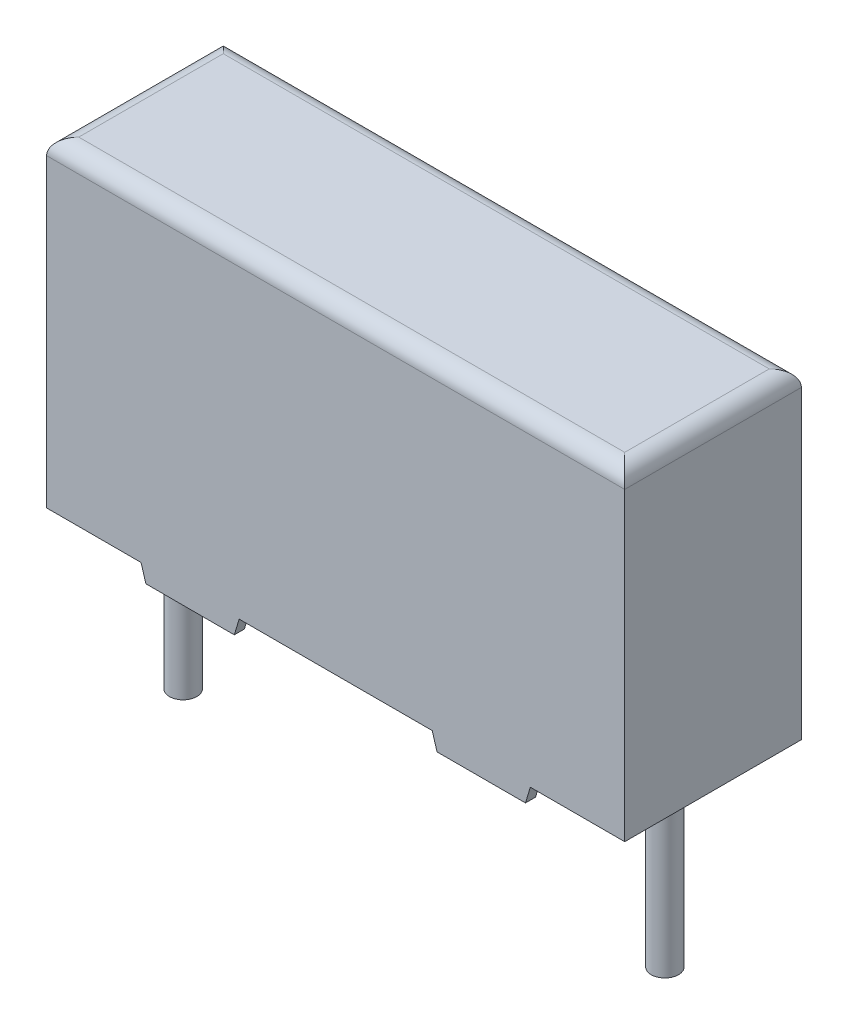
ISO-10303-21;
HEADER;
FILE_DESCRIPTION(('STEP AP214'),'2;1');
FILE_NAME('part.step','',(''),(''),'','','');
FILE_SCHEMA(('AUTOMOTIVE_DESIGN { 1 0 10303 214 1 1 1 1 }'));
ENDSEC;
DATA;
#1=APPLICATION_CONTEXT('core data for automotive mechanical design processes');
#2=APPLICATION_PROTOCOL_DEFINITION('international standard','automotive_design',2000,#1);
#3=PRODUCT_CONTEXT('',#1,'mechanical');
#4=PRODUCT('Part','Part','',(#3));
#5=PRODUCT_RELATED_PRODUCT_CATEGORY('part','',(#4));
#6=PRODUCT_DEFINITION_FORMATION('','',#4);
#7=PRODUCT_DEFINITION_CONTEXT('part definition',#1,'design');
#8=PRODUCT_DEFINITION('design','',#6,#7);
#9=PRODUCT_DEFINITION_SHAPE('','',#8);
#10=(LENGTH_UNIT() NAMED_UNIT(*) SI_UNIT(.MILLI.,.METRE.));
#11=(NAMED_UNIT(*) PLANE_ANGLE_UNIT() SI_UNIT($,.RADIAN.));
#12=(NAMED_UNIT(*) SI_UNIT($,.STERADIAN.) SOLID_ANGLE_UNIT());
#13=UNCERTAINTY_MEASURE_WITH_UNIT(LENGTH_MEASURE(1.E-05),#10,'distance_accuracy_value','');
#14=(GEOMETRIC_REPRESENTATION_CONTEXT(3) GLOBAL_UNCERTAINTY_ASSIGNED_CONTEXT((#13)) GLOBAL_UNIT_ASSIGNED_CONTEXT((#10,
#11,#12)) REPRESENTATION_CONTEXT('',''));
#15=CARTESIAN_POINT('',(0.,0.,0.));
#16=DIRECTION('',(0.,0.,1.));
#17=DIRECTION('',(1.,0.,0.));
#18=AXIS2_PLACEMENT_3D('',#15,#16,#17);
#19=CARTESIAN_POINT('',(16.5,-5.5,2.75));
#20=DIRECTION('',(0.,1.,0.));
#21=DIRECTION('',(0.,0.,1.));
#22=AXIS2_PLACEMENT_3D('',#19,#20,#21);
#23=CYLINDRICAL_SURFACE('',#22,0.425);
#24=CARTESIAN_POINT('',(16.5,-5.5,2.75));
#25=DIRECTION('',(0.,1.,0.));
#26=DIRECTION('',(0.,0.,-1.));
#27=AXIS2_PLACEMENT_3D('',#24,#25,#26);
#28=CIRCLE('',#27,0.425);
#29=CARTESIAN_POINT('',(16.5,-5.5,2.325));
#30=VERTEX_POINT('',#29);
#31=EDGE_CURVE('E11',#30,#30,#28,.T.);
#32=ORIENTED_EDGE('',*,*,#31,.T.);
#33=EDGE_LOOP('',(#32));
#34=FACE_BOUND('',#33,.T.);
#35=CARTESIAN_POINT('',(16.5,0.,2.75));
#36=DIRECTION('',(0.,1.,0.));
#37=DIRECTION('',(0.,0.,-1.));
#38=AXIS2_PLACEMENT_3D('',#35,#36,#37);
#39=CIRCLE('',#38,0.425);
#40=CARTESIAN_POINT('',(16.5,0.,3.175));
#41=VERTEX_POINT('',#40);
#42=EDGE_CURVE('E398',#41,#41,#39,.T.);
#43=ORIENTED_EDGE('',*,*,#42,.F.);
#44=EDGE_LOOP('',(#43));
#45=FACE_BOUND('',#44,.T.);
#46=ADVANCED_FACE('F17',(#34,#45),#23,.T.);
#47=CARTESIAN_POINT('',(1.5,-5.5,2.75));
#48=DIRECTION('',(0.,1.,0.));
#49=DIRECTION('',(0.,0.,1.));
#50=AXIS2_PLACEMENT_3D('',#47,#48,#49);
#51=CYLINDRICAL_SURFACE('',#50,0.425);
#52=CARTESIAN_POINT('',(1.5,-5.5,2.75));
#53=DIRECTION('',(0.,-1.,0.));
#54=DIRECTION('',(0.,0.,-1.));
#55=AXIS2_PLACEMENT_3D('',#52,#53,#54);
#56=CIRCLE('',#55,0.425);
#57=CARTESIAN_POINT('',(1.5,-5.5,3.175));
#58=VERTEX_POINT('',#57);
#59=EDGE_CURVE('E344',#58,#58,#56,.T.);
#60=ORIENTED_EDGE('',*,*,#59,.F.);
#61=EDGE_LOOP('',(#60));
#62=FACE_BOUND('',#61,.T.);
#63=CARTESIAN_POINT('',(1.5,0.,2.75));
#64=DIRECTION('',(0.,-1.,0.));
#65=DIRECTION('',(0.,0.,1.));
#66=AXIS2_PLACEMENT_3D('',#63,#64,#65);
#67=CIRCLE('',#66,0.425);
#68=CARTESIAN_POINT('',(1.5,0.,3.175));
#69=VERTEX_POINT('',#68);
#70=EDGE_CURVE('E28',#69,#69,#67,.T.);
#71=ORIENTED_EDGE('',*,*,#70,.T.);
#72=EDGE_LOOP('',(#71));
#73=FACE_BOUND('',#72,.T.);
#74=ADVANCED_FACE('F598',(#62,#73),#51,.T.);
#75=CARTESIAN_POINT('',(0.,0.,5.5));
#76=DIRECTION('',(0.,1.,0.));
#77=DIRECTION('',(1.,0.,0.));
#78=AXIS2_PLACEMENT_3D('',#75,#76,#77);
#79=PLANE('',#78);
#80=DIRECTION('',(0.,0.,-1.));
#81=VECTOR('',#80,1.);
#82=CARTESIAN_POINT('',(2.94,0.,0.3135));
#83=LINE('',#82,#81);
#84=CARTESIAN_POINT('',(2.94,0.,0.3135));
#85=VERTEX_POINT('',#84);
#86=CARTESIAN_POINT('',(2.94,0.,0.));
#87=VERTEX_POINT('',#86);
#88=EDGE_CURVE('E397',#85,#87,#83,.T.);
#89=ORIENTED_EDGE('',*,*,#88,.F.);
#90=DIRECTION('',(-1.,0.,0.));
#91=VECTOR('',#90,1.);
#92=CARTESIAN_POINT('',(2.94,0.,0.3135));
#93=LINE('',#92,#91);
#94=CARTESIAN_POINT('',(5.994,0.,0.3135));
#95=VERTEX_POINT('',#94);
#96=EDGE_CURVE('E393',#95,#85,#93,.T.);
#97=ORIENTED_EDGE('',*,*,#96,.F.);
#98=DIRECTION('',(0.,0.,-1.));
#99=VECTOR('',#98,1.);
#100=CARTESIAN_POINT('',(5.994,0.,0.3135));
#101=LINE('',#100,#99);
#102=CARTESIAN_POINT('',(5.994,0.,0.));
#103=VERTEX_POINT('',#102);
#104=EDGE_CURVE('E286',#95,#103,#101,.T.);
#105=ORIENTED_EDGE('',*,*,#104,.T.);
#106=DIRECTION('',(1.,0.,0.));
#107=VECTOR('',#106,1.);
#108=CARTESIAN_POINT('',(0.,0.,0.));
#109=LINE('',#108,#107);
#110=CARTESIAN_POINT('',(12.006,0.,0.));
#111=VERTEX_POINT('',#110);
#112=EDGE_CURVE('E284',#103,#111,#109,.T.);
#113=ORIENTED_EDGE('',*,*,#112,.T.);
#114=DIRECTION('',(0.,0.,-1.));
#115=VECTOR('',#114,1.);
#116=CARTESIAN_POINT('',(12.006,0.,0.3135));
#117=LINE('',#116,#115);
#118=CARTESIAN_POINT('',(12.006,0.,0.3135));
#119=VERTEX_POINT('',#118);
#120=EDGE_CURVE('E461',#119,#111,#117,.T.);
#121=ORIENTED_EDGE('',*,*,#120,.F.);
#122=DIRECTION('',(1.,0.,0.));
#123=VECTOR('',#122,1.);
#124=CARTESIAN_POINT('',(15.06,0.,0.3135));
#125=LINE('',#124,#123);
#126=CARTESIAN_POINT('',(15.06,0.,0.3135));
#127=VERTEX_POINT('',#126);
#128=EDGE_CURVE('E287',#119,#127,#125,.T.);
#129=ORIENTED_EDGE('',*,*,#128,.T.);
#130=DIRECTION('',(0.,0.,-1.));
#131=VECTOR('',#130,1.);
#132=CARTESIAN_POINT('',(15.06,0.,0.3135));
#133=LINE('',#132,#131);
#134=CARTESIAN_POINT('',(15.06,0.,0.));
#135=VERTEX_POINT('',#134);
#136=EDGE_CURVE('E183',#127,#135,#133,.T.);
#137=ORIENTED_EDGE('',*,*,#136,.T.);
#138=DIRECTION('',(1.,0.,0.));
#139=VECTOR('',#138,1.);
#140=CARTESIAN_POINT('',(0.,0.,0.));
#141=LINE('',#140,#139);
#142=CARTESIAN_POINT('',(18.,0.,0.));
#143=VERTEX_POINT('',#142);
#144=EDGE_CURVE('E171',#135,#143,#141,.T.);
#145=ORIENTED_EDGE('',*,*,#144,.T.);
#146=DIRECTION('',(0.,0.,-1.));
#147=VECTOR('',#146,1.);
#148=CARTESIAN_POINT('',(18.,0.,5.5));
#149=LINE('',#148,#147);
#150=CARTESIAN_POINT('',(18.,0.,5.5));
#151=VERTEX_POINT('',#150);
#152=EDGE_CURVE('E330',#151,#143,#149,.T.);
#153=ORIENTED_EDGE('',*,*,#152,.F.);
#154=DIRECTION('',(1.,0.,0.));
#155=VECTOR('',#154,1.);
#156=CARTESIAN_POINT('',(0.,0.,5.5));
#157=LINE('',#156,#155);
#158=CARTESIAN_POINT('',(15.06,0.,5.5));
#159=VERTEX_POINT('',#158);
#160=EDGE_CURVE('E419',#159,#151,#157,.T.);
#161=ORIENTED_EDGE('',*,*,#160,.F.);
#162=DIRECTION('',(0.,0.,1.));
#163=VECTOR('',#162,1.);
#164=CARTESIAN_POINT('',(15.06,0.,5.1865));
#165=LINE('',#164,#163);
#166=CARTESIAN_POINT('',(15.06,0.,5.1865));
#167=VERTEX_POINT('',#166);
#168=EDGE_CURVE('E256',#167,#159,#165,.T.);
#169=ORIENTED_EDGE('',*,*,#168,.F.);
#170=DIRECTION('',(1.,0.,0.));
#171=VECTOR('',#170,1.);
#172=CARTESIAN_POINT('',(15.06,0.,5.1865));
#173=LINE('',#172,#171);
#174=CARTESIAN_POINT('',(12.006,0.,5.1865));
#175=VERTEX_POINT('',#174);
#176=EDGE_CURVE('E407',#175,#167,#173,.T.);
#177=ORIENTED_EDGE('',*,*,#176,.F.);
#178=DIRECTION('',(0.,0.,1.));
#179=VECTOR('',#178,1.);
#180=CARTESIAN_POINT('',(12.006,0.,5.1865));
#181=LINE('',#180,#179);
#182=CARTESIAN_POINT('',(12.006,0.,5.5));
#183=VERTEX_POINT('',#182);
#184=EDGE_CURVE('E362',#175,#183,#181,.T.);
#185=ORIENTED_EDGE('',*,*,#184,.T.);
#186=DIRECTION('',(1.,0.,0.));
#187=VECTOR('',#186,1.);
#188=CARTESIAN_POINT('',(0.,0.,5.5));
#189=LINE('',#188,#187);
#190=CARTESIAN_POINT('',(5.994,0.,5.5));
#191=VERTEX_POINT('',#190);
#192=EDGE_CURVE('E431',#191,#183,#189,.T.);
#193=ORIENTED_EDGE('',*,*,#192,.F.);
#194=DIRECTION('',(0.,0.,1.));
#195=VECTOR('',#194,1.);
#196=CARTESIAN_POINT('',(5.994,0.,5.1865));
#197=LINE('',#196,#195);
#198=CARTESIAN_POINT('',(5.994,0.,5.1865));
#199=VERTEX_POINT('',#198);
#200=EDGE_CURVE('E366',#199,#191,#197,.T.);
#201=ORIENTED_EDGE('',*,*,#200,.F.);
#202=DIRECTION('',(-1.,0.,0.));
#203=VECTOR('',#202,1.);
#204=CARTESIAN_POINT('',(2.94,0.,5.1865));
#205=LINE('',#204,#203);
#206=CARTESIAN_POINT('',(2.94,0.,5.1865));
#207=VERTEX_POINT('',#206);
#208=EDGE_CURVE('E357',#199,#207,#205,.T.);
#209=ORIENTED_EDGE('',*,*,#208,.T.);
#210=DIRECTION('',(0.,0.,1.));
#211=VECTOR('',#210,1.);
#212=CARTESIAN_POINT('',(2.94,0.,5.1865));
#213=LINE('',#212,#211);
#214=CARTESIAN_POINT('',(2.94,0.,5.5));
#215=VERTEX_POINT('',#214);
#216=EDGE_CURVE('E353',#207,#215,#213,.T.);
#217=ORIENTED_EDGE('',*,*,#216,.T.);
#218=DIRECTION('',(1.,0.,0.));
#219=VECTOR('',#218,1.);
#220=CARTESIAN_POINT('',(0.,0.,5.5));
#221=LINE('',#220,#219);
#222=CARTESIAN_POINT('',(0.,0.,5.5));
#223=VERTEX_POINT('',#222);
#224=EDGE_CURVE('E314',#223,#215,#221,.T.);
#225=ORIENTED_EDGE('',*,*,#224,.F.);
#226=DIRECTION('',(0.,0.,-1.));
#227=VECTOR('',#226,1.);
#228=CARTESIAN_POINT('',(0.,0.,5.5));
#229=LINE('',#228,#227);
#230=CARTESIAN_POINT('',(0.,0.,0.));
#231=VERTEX_POINT('',#230);
#232=EDGE_CURVE('E358',#223,#231,#229,.T.);
#233=ORIENTED_EDGE('',*,*,#232,.T.);
#234=DIRECTION('',(1.,0.,0.));
#235=VECTOR('',#234,1.);
#236=CARTESIAN_POINT('',(0.,0.,0.));
#237=LINE('',#236,#235);
#238=EDGE_CURVE('E402',#231,#87,#237,.T.);
#239=ORIENTED_EDGE('',*,*,#238,.T.);
#240=EDGE_LOOP('',(#89,#97,#105,#113,#121,#129,#137,#145,#153,#161,#169,#177,#185,#193,#201,
#209,#217,#225,#233,#239));
#241=FACE_BOUND('',#240,.T.);
#242=ORIENTED_EDGE('',*,*,#42,.T.);
#243=EDGE_LOOP('',(#242));
#244=FACE_BOUND('',#243,.T.);
#245=ORIENTED_EDGE('',*,*,#70,.F.);
#246=EDGE_LOOP('',(#245));
#247=FACE_BOUND('',#246,.T.);
#248=ADVANCED_FACE('F529',(#241,#244,#247),#79,.F.);
#249=CARTESIAN_POINT('',(0.,0.,5.5));
#250=DIRECTION('',(1.,0.,0.));
#251=DIRECTION('',(0.,1.,0.));
#252=AXIS2_PLACEMENT_3D('',#249,#250,#251);
#253=PLANE('',#252);
#254=DIRECTION('',(0.,-1.,0.));
#255=VECTOR('',#254,1.);
#256=CARTESIAN_POINT('',(0.,0.,5.5));
#257=LINE('',#256,#255);
#258=CARTESIAN_POINT('',(0.,9.5,5.5));
#259=VERTEX_POINT('',#258);
#260=EDGE_CURVE('E446',#259,#223,#257,.T.);
#261=ORIENTED_EDGE('',*,*,#260,.F.);
#262=DIRECTION('',(0.,0.,-1.));
#263=VECTOR('',#262,1.);
#264=CARTESIAN_POINT('',(0.,9.5,5.5));
#265=LINE('',#264,#263);
#266=CARTESIAN_POINT('',(0.,9.5,0.));
#267=VERTEX_POINT('',#266);
#268=EDGE_CURVE('E388',#259,#267,#265,.T.);
#269=ORIENTED_EDGE('',*,*,#268,.T.);
#270=DIRECTION('',(0.,-1.,0.));
#271=VECTOR('',#270,1.);
#272=CARTESIAN_POINT('',(0.,0.,0.));
#273=LINE('',#272,#271);
#274=EDGE_CURVE('E352',#267,#231,#273,.T.);
#275=ORIENTED_EDGE('',*,*,#274,.T.);
#276=ORIENTED_EDGE('',*,*,#232,.F.);
#277=EDGE_LOOP('',(#261,#269,#275,#276));
#278=FACE_BOUND('',#277,.T.);
#279=ADVANCED_FACE('F569',(#278),#253,.F.);
#280=CARTESIAN_POINT('',(18.,0.,5.5));
#281=DIRECTION('',(-1.,0.,0.));
#282=DIRECTION('',(0.,0.,1.));
#283=AXIS2_PLACEMENT_3D('',#280,#281,#282);
#284=PLANE('',#283);
#285=DIRECTION('',(0.,1.,0.));
#286=VECTOR('',#285,1.);
#287=CARTESIAN_POINT('',(18.,0.,0.));
#288=LINE('',#287,#286);
#289=CARTESIAN_POINT('',(18.,9.5,0.));
#290=VERTEX_POINT('',#289);
#291=EDGE_CURVE('E348',#143,#290,#288,.T.);
#292=ORIENTED_EDGE('',*,*,#291,.T.);
#293=DIRECTION('',(0.,0.,1.));
#294=VECTOR('',#293,1.);
#295=CARTESIAN_POINT('',(18.,9.5,5.5));
#296=LINE('',#295,#294);
#297=CARTESIAN_POINT('',(18.,9.5,5.5));
#298=VERTEX_POINT('',#297);
#299=EDGE_CURVE('E336',#290,#298,#296,.T.);
#300=ORIENTED_EDGE('',*,*,#299,.T.);
#301=DIRECTION('',(0.,1.,0.));
#302=VECTOR('',#301,1.);
#303=CARTESIAN_POINT('',(18.,0.,5.5));
#304=LINE('',#303,#302);
#305=EDGE_CURVE('E361',#151,#298,#304,.T.);
#306=ORIENTED_EDGE('',*,*,#305,.F.);
#307=ORIENTED_EDGE('',*,*,#152,.T.);
#308=EDGE_LOOP('',(#292,#300,#306,#307));
#309=FACE_BOUND('',#308,.T.);
#310=ADVANCED_FACE('F584',(#309),#284,.F.);
#311=CARTESIAN_POINT('',(0.,10.,5.5));
#312=DIRECTION('',(0.,-1.,0.));
#313=DIRECTION('',(0.,0.,-1.));
#314=AXIS2_PLACEMENT_3D('',#311,#312,#313);
#315=PLANE('',#314);
#316=DIRECTION('',(1.,0.,0.));
#317=VECTOR('',#316,1.);
#318=CARTESIAN_POINT('',(0.,10.,5.));
#319=LINE('',#318,#317);
#320=CARTESIAN_POINT('',(0.5,10.,5.));
#321=VERTEX_POINT('',#320);
#322=CARTESIAN_POINT('',(17.5,10.,5.));
#323=VERTEX_POINT('',#322);
#324=EDGE_CURVE('E282',#321,#323,#319,.T.);
#325=ORIENTED_EDGE('',*,*,#324,.T.);
#326=DIRECTION('',(0.,0.,-1.));
#327=VECTOR('',#326,1.);
#328=CARTESIAN_POINT('',(17.5,10.,5.5));
#329=LINE('',#328,#327);
#330=CARTESIAN_POINT('',(17.5,10.,0.5));
#331=VERTEX_POINT('',#330);
#332=EDGE_CURVE('E299',#323,#331,#329,.T.);
#333=ORIENTED_EDGE('',*,*,#332,.T.);
#334=DIRECTION('',(-1.,0.,0.));
#335=VECTOR('',#334,1.);
#336=CARTESIAN_POINT('',(0.,10.,0.5));
#337=LINE('',#336,#335);
#338=CARTESIAN_POINT('',(0.5,10.,0.5));
#339=VERTEX_POINT('',#338);
#340=EDGE_CURVE('E295',#331,#339,#337,.T.);
#341=ORIENTED_EDGE('',*,*,#340,.T.);
#342=DIRECTION('',(0.,0.,1.));
#343=VECTOR('',#342,1.);
#344=CARTESIAN_POINT('',(0.5,10.,5.5));
#345=LINE('',#344,#343);
#346=EDGE_CURVE('E300',#339,#321,#345,.T.);
#347=ORIENTED_EDGE('',*,*,#346,.T.);
#348=EDGE_LOOP('',(#325,#333,#341,#347));
#349=FACE_BOUND('',#348,.T.);
#350=ADVANCED_FACE('F577',(#349),#315,.F.);
#351=CARTESIAN_POINT('',(0.,0.,5.5));
#352=DIRECTION('',(0.,0.,-1.));
#353=DIRECTION('',(0.,-1.,0.));
#354=AXIS2_PLACEMENT_3D('',#351,#352,#353);
#355=PLANE('',#354);
#356=ORIENTED_EDGE('',*,*,#305,.T.);
#357=DIRECTION('',(-1.,0.,0.));
#358=VECTOR('',#357,1.);
#359=CARTESIAN_POINT('',(0.,9.5,5.5));
#360=LINE('',#359,#358);
#361=EDGE_CURVE('E442',#298,#259,#360,.T.);
#362=ORIENTED_EDGE('',*,*,#361,.T.);
#363=ORIENTED_EDGE('',*,*,#260,.T.);
#364=ORIENTED_EDGE('',*,*,#224,.T.);
#365=DIRECTION('',(0.287347885566346,-0.957826285221151,0.));
#366=VECTOR('',#365,1.);
#367=CARTESIAN_POINT('',(2.94,0.,5.5));
#368=LINE('',#367,#366);
#369=CARTESIAN_POINT('',(3.09,-0.5,5.5));
#370=VERTEX_POINT('',#369);
#371=EDGE_CURVE('E307',#215,#370,#368,.T.);
#372=ORIENTED_EDGE('',*,*,#371,.T.);
#373=DIRECTION('',(1.,0.,0.));
#374=VECTOR('',#373,1.);
#375=CARTESIAN_POINT('',(3.09,-0.5,5.5));
#376=LINE('',#375,#374);
#377=CARTESIAN_POINT('',(5.844,-0.5,5.5));
#378=VERTEX_POINT('',#377);
#379=EDGE_CURVE('E315',#370,#378,#376,.T.);
#380=ORIENTED_EDGE('',*,*,#379,.T.);
#381=DIRECTION('',(0.287347885566346,0.957826285221151,0.));
#382=VECTOR('',#381,1.);
#383=CARTESIAN_POINT('',(5.844,-0.5,5.5));
#384=LINE('',#383,#382);
#385=EDGE_CURVE('E434',#378,#191,#384,.T.);
#386=ORIENTED_EDGE('',*,*,#385,.T.);
#387=ORIENTED_EDGE('',*,*,#192,.T.);
#388=DIRECTION('',(-0.287347885566346,0.957826285221151,0.));
#389=VECTOR('',#388,1.);
#390=CARTESIAN_POINT('',(12.156,-0.5,5.5));
#391=LINE('',#390,#389);
#392=CARTESIAN_POINT('',(12.156,-0.5,5.5));
#393=VERTEX_POINT('',#392);
#394=EDGE_CURVE('E240',#393,#183,#391,.T.);
#395=ORIENTED_EDGE('',*,*,#394,.F.);
#396=DIRECTION('',(-1.,0.,0.));
#397=VECTOR('',#396,1.);
#398=CARTESIAN_POINT('',(14.91,-0.5,5.5));
#399=LINE('',#398,#397);
#400=CARTESIAN_POINT('',(14.91,-0.5,5.5));
#401=VERTEX_POINT('',#400);
#402=EDGE_CURVE('E246',#401,#393,#399,.T.);
#403=ORIENTED_EDGE('',*,*,#402,.F.);
#404=DIRECTION('',(-0.287347885566346,-0.957826285221151,0.));
#405=VECTOR('',#404,1.);
#406=CARTESIAN_POINT('',(15.06,0.,5.5));
#407=LINE('',#406,#405);
#408=EDGE_CURVE('E250',#159,#401,#407,.T.);
#409=ORIENTED_EDGE('',*,*,#408,.F.);
#410=ORIENTED_EDGE('',*,*,#160,.T.);
#411=EDGE_LOOP('',(#356,#362,#363,#364,#372,#380,#386,#387,#395,#403,#409,#410));
#412=FACE_BOUND('',#411,.T.);
#413=ADVANCED_FACE('F249',(#412),#355,.F.);
#414=CARTESIAN_POINT('',(0.,0.,0.));
#415=DIRECTION('',(0.,0.,-1.));
#416=DIRECTION('',(0.,-1.,0.));
#417=AXIS2_PLACEMENT_3D('',#414,#415,#416);
#418=PLANE('',#417);
#419=ORIENTED_EDGE('',*,*,#274,.F.);
#420=DIRECTION('',(1.,0.,0.));
#421=VECTOR('',#420,1.);
#422=CARTESIAN_POINT('',(18.,9.5,0.));
#423=LINE('',#422,#421);
#424=EDGE_CURVE('E90',#267,#290,#423,.T.);
#425=ORIENTED_EDGE('',*,*,#424,.T.);
#426=ORIENTED_EDGE('',*,*,#291,.F.);
#427=ORIENTED_EDGE('',*,*,#144,.F.);
#428=DIRECTION('',(-0.287347885566346,-0.957826285221151,0.));
#429=VECTOR('',#428,1.);
#430=CARTESIAN_POINT('',(15.06,0.,0.));
#431=LINE('',#430,#429);
#432=CARTESIAN_POINT('',(14.91,-0.5,0.));
#433=VERTEX_POINT('',#432);
#434=EDGE_CURVE('E420',#135,#433,#431,.T.);
#435=ORIENTED_EDGE('',*,*,#434,.T.);
#436=DIRECTION('',(-1.,0.,0.));
#437=VECTOR('',#436,1.);
#438=CARTESIAN_POINT('',(14.91,-0.5,0.));
#439=LINE('',#438,#437);
#440=CARTESIAN_POINT('',(12.156,-0.5,0.));
#441=VERTEX_POINT('',#440);
#442=EDGE_CURVE('E449',#433,#441,#439,.T.);
#443=ORIENTED_EDGE('',*,*,#442,.T.);
#444=DIRECTION('',(-0.287347885566346,0.957826285221151,0.));
#445=VECTOR('',#444,1.);
#446=CARTESIAN_POINT('',(12.156,-0.5,0.));
#447=LINE('',#446,#445);
#448=EDGE_CURVE('E456',#441,#111,#447,.T.);
#449=ORIENTED_EDGE('',*,*,#448,.T.);
#450=ORIENTED_EDGE('',*,*,#112,.F.);
#451=DIRECTION('',(0.287347885566346,0.957826285221151,0.));
#452=VECTOR('',#451,1.);
#453=CARTESIAN_POINT('',(5.844,-0.5,0.));
#454=LINE('',#453,#452);
#455=CARTESIAN_POINT('',(5.844,-0.5,0.));
#456=VERTEX_POINT('',#455);
#457=EDGE_CURVE('E377',#456,#103,#454,.T.);
#458=ORIENTED_EDGE('',*,*,#457,.F.);
#459=DIRECTION('',(1.,0.,0.));
#460=VECTOR('',#459,1.);
#461=CARTESIAN_POINT('',(3.09,-0.5,0.));
#462=LINE('',#461,#460);
#463=CARTESIAN_POINT('',(3.09,-0.5,0.));
#464=VERTEX_POINT('',#463);
#465=EDGE_CURVE('E376',#464,#456,#462,.T.);
#466=ORIENTED_EDGE('',*,*,#465,.F.);
#467=DIRECTION('',(0.287347885566346,-0.957826285221151,0.));
#468=VECTOR('',#467,1.);
#469=CARTESIAN_POINT('',(2.94,0.,0.));
#470=LINE('',#469,#468);
#471=EDGE_CURVE('E435',#87,#464,#470,.T.);
#472=ORIENTED_EDGE('',*,*,#471,.F.);
#473=ORIENTED_EDGE('',*,*,#238,.F.);
#474=EDGE_LOOP('',(#419,#425,#426,#427,#435,#443,#449,#450,#458,#466,#472,#473));
#475=FACE_BOUND('',#474,.T.);
#476=ADVANCED_FACE('F541',(#475),#418,.T.);
#477=CARTESIAN_POINT('',(5.844,-0.5,5.1865));
#478=DIRECTION('',(0.957826285221151,-0.287347885566346,0.));
#479=DIRECTION('',(0.,0.,-1.));
#480=AXIS2_PLACEMENT_3D('',#477,#478,#479);
#481=PLANE('',#480);
#482=ORIENTED_EDGE('',*,*,#385,.F.);
#483=DIRECTION('',(0.,0.,1.));
#484=VECTOR('',#483,1.);
#485=CARTESIAN_POINT('',(5.844,-0.5,5.1865));
#486=LINE('',#485,#484);
#487=CARTESIAN_POINT('',(5.844,-0.5,5.1865));
#488=VERTEX_POINT('',#487);
#489=EDGE_CURVE('E21',#488,#378,#486,.T.);
#490=ORIENTED_EDGE('',*,*,#489,.F.);
#491=DIRECTION('',(0.287347885566346,0.957826285221151,0.));
#492=VECTOR('',#491,1.);
#493=CARTESIAN_POINT('',(5.844,-0.5,5.1865));
#494=LINE('',#493,#492);
#495=EDGE_CURVE('E370',#488,#199,#494,.T.);
#496=ORIENTED_EDGE('',*,*,#495,.T.);
#497=ORIENTED_EDGE('',*,*,#200,.T.);
#498=EDGE_LOOP('',(#482,#490,#496,#497));
#499=FACE_BOUND('',#498,.T.);
#500=ADVANCED_FACE('F624',(#499),#481,.T.);
#501=CARTESIAN_POINT('',(3.09,-0.5,5.1865));
#502=DIRECTION('',(0.,-1.,0.));
#503=DIRECTION('',(0.,0.,-1.));
#504=AXIS2_PLACEMENT_3D('',#501,#502,#503);
#505=PLANE('',#504);
#506=ORIENTED_EDGE('',*,*,#379,.F.);
#507=DIRECTION('',(0.,0.,1.));
#508=VECTOR('',#507,1.);
#509=CARTESIAN_POINT('',(3.09,-0.5,5.1865));
#510=LINE('',#509,#508);
#511=CARTESIAN_POINT('',(3.09,-0.5,5.1865));
#512=VERTEX_POINT('',#511);
#513=EDGE_CURVE('E267',#512,#370,#510,.T.);
#514=ORIENTED_EDGE('',*,*,#513,.F.);
#515=DIRECTION('',(1.,0.,0.));
#516=VECTOR('',#515,1.);
#517=CARTESIAN_POINT('',(3.09,-0.5,5.1865));
#518=LINE('',#517,#516);
#519=EDGE_CURVE('E371',#512,#488,#518,.T.);
#520=ORIENTED_EDGE('',*,*,#519,.T.);
#521=ORIENTED_EDGE('',*,*,#489,.T.);
#522=EDGE_LOOP('',(#506,#514,#520,#521));
#523=FACE_BOUND('',#522,.T.);
#524=ADVANCED_FACE('F645',(#523),#505,.T.);
#525=CARTESIAN_POINT('',(2.94,0.,5.1865));
#526=DIRECTION('',(-0.957826285221151,-0.287347885566346,0.));
#527=DIRECTION('',(-0.287347885566346,0.957826285221151,0.));
#528=AXIS2_PLACEMENT_3D('',#525,#526,#527);
#529=PLANE('',#528);
#530=ORIENTED_EDGE('',*,*,#371,.F.);
#531=ORIENTED_EDGE('',*,*,#216,.F.);
#532=DIRECTION('',(0.287347885566346,-0.957826285221151,0.));
#533=VECTOR('',#532,1.);
#534=CARTESIAN_POINT('',(2.94,0.,5.1865));
#535=LINE('',#534,#533);
#536=EDGE_CURVE('E316',#207,#512,#535,.T.);
#537=ORIENTED_EDGE('',*,*,#536,.T.);
#538=ORIENTED_EDGE('',*,*,#513,.T.);
#539=EDGE_LOOP('',(#530,#531,#537,#538));
#540=FACE_BOUND('',#539,.T.);
#541=ADVANCED_FACE('F618',(#540),#529,.T.);
#542=CARTESIAN_POINT('',(0.,0.,5.1865));
#543=DIRECTION('',(0.,0.,1.));
#544=DIRECTION('',(1.,0.,0.));
#545=AXIS2_PLACEMENT_3D('',#542,#543,#544);
#546=PLANE('',#545);
#547=ORIENTED_EDGE('',*,*,#208,.F.);
#548=ORIENTED_EDGE('',*,*,#495,.F.);
#549=ORIENTED_EDGE('',*,*,#519,.F.);
#550=ORIENTED_EDGE('',*,*,#536,.F.);
#551=EDGE_LOOP('',(#547,#548,#549,#550));
#552=FACE_BOUND('',#551,.T.);
#553=ADVANCED_FACE('F615',(#552),#546,.F.);
#554=CARTESIAN_POINT('',(15.06,0.,5.1865));
#555=DIRECTION('',(-0.957826285221151,0.287347885566346,0.));
#556=DIRECTION('',(0.,0.,1.));
#557=AXIS2_PLACEMENT_3D('',#554,#555,#556);
#558=PLANE('',#557);
#559=ORIENTED_EDGE('',*,*,#408,.T.);
#560=DIRECTION('',(0.,0.,1.));
#561=VECTOR('',#560,1.);
#562=CARTESIAN_POINT('',(14.91,-0.5,5.1865));
#563=LINE('',#562,#561);
#564=CARTESIAN_POINT('',(14.91,-0.5,5.1865));
#565=VERTEX_POINT('',#564);
#566=EDGE_CURVE('E257',#565,#401,#563,.T.);
#567=ORIENTED_EDGE('',*,*,#566,.F.);
#568=DIRECTION('',(-0.287347885566346,-0.957826285221151,0.));
#569=VECTOR('',#568,1.);
#570=CARTESIAN_POINT('',(15.06,0.,5.1865));
#571=LINE('',#570,#569);
#572=EDGE_CURVE('E380',#167,#565,#571,.T.);
#573=ORIENTED_EDGE('',*,*,#572,.F.);
#574=ORIENTED_EDGE('',*,*,#168,.T.);
#575=EDGE_LOOP('',(#559,#567,#573,#574));
#576=FACE_BOUND('',#575,.T.);
#577=ADVANCED_FACE('F261',(#576),#558,.F.);
#578=CARTESIAN_POINT('',(14.91,-0.5,5.1865));
#579=DIRECTION('',(0.,1.,0.));
#580=DIRECTION('',(1.,0.,0.));
#581=AXIS2_PLACEMENT_3D('',#578,#579,#580);
#582=PLANE('',#581);
#583=ORIENTED_EDGE('',*,*,#402,.T.);
#584=DIRECTION('',(0.,0.,1.));
#585=VECTOR('',#584,1.);
#586=CARTESIAN_POINT('',(12.156,-0.5,5.1865));
#587=LINE('',#586,#585);
#588=CARTESIAN_POINT('',(12.156,-0.5,5.1865));
#589=VERTEX_POINT('',#588);
#590=EDGE_CURVE('E278',#589,#393,#587,.T.);
#591=ORIENTED_EDGE('',*,*,#590,.F.);
#592=DIRECTION('',(-1.,0.,0.));
#593=VECTOR('',#592,1.);
#594=CARTESIAN_POINT('',(14.91,-0.5,5.1865));
#595=LINE('',#594,#593);
#596=EDGE_CURVE('E270',#565,#589,#595,.T.);
#597=ORIENTED_EDGE('',*,*,#596,.F.);
#598=ORIENTED_EDGE('',*,*,#566,.T.);
#599=EDGE_LOOP('',(#583,#591,#597,#598));
#600=FACE_BOUND('',#599,.T.);
#601=ADVANCED_FACE('F269',(#600),#582,.F.);
#602=CARTESIAN_POINT('',(12.156,-0.5,5.1865));
#603=DIRECTION('',(0.957826285221151,0.287347885566346,0.));
#604=DIRECTION('',(0.,0.,-1.));
#605=AXIS2_PLACEMENT_3D('',#602,#603,#604);
#606=PLANE('',#605);
#607=ORIENTED_EDGE('',*,*,#394,.T.);
#608=ORIENTED_EDGE('',*,*,#184,.F.);
#609=DIRECTION('',(-0.287347885566346,0.957826285221151,0.));
#610=VECTOR('',#609,1.);
#611=CARTESIAN_POINT('',(12.156,-0.5,5.1865));
#612=LINE('',#611,#610);
#613=EDGE_CURVE('E381',#589,#175,#612,.T.);
#614=ORIENTED_EDGE('',*,*,#613,.F.);
#615=ORIENTED_EDGE('',*,*,#590,.T.);
#616=EDGE_LOOP('',(#607,#608,#614,#615));
#617=FACE_BOUND('',#616,.T.);
#618=ADVANCED_FACE('F625',(#617),#606,.F.);
#619=CARTESIAN_POINT('',(18.,0.,5.1865));
#620=DIRECTION('',(0.,0.,1.));
#621=DIRECTION('',(1.,0.,0.));
#622=AXIS2_PLACEMENT_3D('',#619,#620,#621);
#623=PLANE('',#622);
#624=ORIENTED_EDGE('',*,*,#176,.T.);
#625=ORIENTED_EDGE('',*,*,#572,.T.);
#626=ORIENTED_EDGE('',*,*,#596,.T.);
#627=ORIENTED_EDGE('',*,*,#613,.T.);
#628=EDGE_LOOP('',(#624,#625,#626,#627));
#629=FACE_BOUND('',#628,.T.);
#630=ADVANCED_FACE('F628',(#629),#623,.F.);
#631=CARTESIAN_POINT('',(12.156,-0.5,0.3135));
#632=DIRECTION('',(-0.957826285221151,-0.287347885566346,0.));
#633=DIRECTION('',(-0.287347885566346,0.957826285221151,0.));
#634=AXIS2_PLACEMENT_3D('',#631,#632,#633);
#635=PLANE('',#634);
#636=ORIENTED_EDGE('',*,*,#448,.F.);
#637=DIRECTION('',(0.,0.,-1.));
#638=VECTOR('',#637,1.);
#639=CARTESIAN_POINT('',(12.156,-0.5,0.3135));
#640=LINE('',#639,#638);
#641=CARTESIAN_POINT('',(12.156,-0.5,0.3135));
#642=VERTEX_POINT('',#641);
#643=EDGE_CURVE('E340',#642,#441,#640,.T.);
#644=ORIENTED_EDGE('',*,*,#643,.F.);
#645=DIRECTION('',(-0.287347885566346,0.957826285221151,0.));
#646=VECTOR('',#645,1.);
#647=CARTESIAN_POINT('',(12.156,-0.5,0.3135));
#648=LINE('',#647,#646);
#649=EDGE_CURVE('E457',#642,#119,#648,.T.);
#650=ORIENTED_EDGE('',*,*,#649,.T.);
#651=ORIENTED_EDGE('',*,*,#120,.T.);
#652=EDGE_LOOP('',(#636,#644,#650,#651));
#653=FACE_BOUND('',#652,.T.);
#654=ADVANCED_FACE('F543',(#653),#635,.T.);
#655=CARTESIAN_POINT('',(14.91,-0.5,0.3135));
#656=DIRECTION('',(0.,-1.,0.));
#657=DIRECTION('',(0.,0.,-1.));
#658=AXIS2_PLACEMENT_3D('',#655,#656,#657);
#659=PLANE('',#658);
#660=ORIENTED_EDGE('',*,*,#442,.F.);
#661=DIRECTION('',(0.,0.,-1.));
#662=VECTOR('',#661,1.);
#663=CARTESIAN_POINT('',(14.91,-0.5,0.3135));
#664=LINE('',#663,#662);
#665=CARTESIAN_POINT('',(14.91,-0.5,0.3135));
#666=VERTEX_POINT('',#665);
#667=EDGE_CURVE('E341',#666,#433,#664,.T.);
#668=ORIENTED_EDGE('',*,*,#667,.F.);
#669=DIRECTION('',(-1.,0.,0.));
#670=VECTOR('',#669,1.);
#671=CARTESIAN_POINT('',(14.91,-0.5,0.3135));
#672=LINE('',#671,#670);
#673=EDGE_CURVE('E416',#666,#642,#672,.T.);
#674=ORIENTED_EDGE('',*,*,#673,.T.);
#675=ORIENTED_EDGE('',*,*,#643,.T.);
#676=EDGE_LOOP('',(#660,#668,#674,#675));
#677=FACE_BOUND('',#676,.T.);
#678=ADVANCED_FACE('F19',(#677),#659,.T.);
#679=CARTESIAN_POINT('',(15.06,0.,0.3135));
#680=DIRECTION('',(0.957826285221151,-0.287347885566346,0.));
#681=DIRECTION('',(0.,0.,-1.));
#682=AXIS2_PLACEMENT_3D('',#679,#680,#681);
#683=PLANE('',#682);
#684=ORIENTED_EDGE('',*,*,#434,.F.);
#685=ORIENTED_EDGE('',*,*,#136,.F.);
#686=DIRECTION('',(-0.287347885566346,-0.957826285221151,0.));
#687=VECTOR('',#686,1.);
#688=CARTESIAN_POINT('',(15.06,0.,0.3135));
#689=LINE('',#688,#687);
#690=EDGE_CURVE('E337',#127,#666,#689,.T.);
#691=ORIENTED_EDGE('',*,*,#690,.T.);
#692=ORIENTED_EDGE('',*,*,#667,.T.);
#693=EDGE_LOOP('',(#684,#685,#691,#692));
#694=FACE_BOUND('',#693,.T.);
#695=ADVANCED_FACE('F586',(#694),#683,.T.);
#696=CARTESIAN_POINT('',(18.,0.,0.3135));
#697=DIRECTION('',(0.,0.,-1.));
#698=DIRECTION('',(0.,-1.,0.));
#699=AXIS2_PLACEMENT_3D('',#696,#697,#698);
#700=PLANE('',#699);
#701=ORIENTED_EDGE('',*,*,#128,.F.);
#702=ORIENTED_EDGE('',*,*,#649,.F.);
#703=ORIENTED_EDGE('',*,*,#673,.F.);
#704=ORIENTED_EDGE('',*,*,#690,.F.);
#705=EDGE_LOOP('',(#701,#702,#703,#704));
#706=FACE_BOUND('',#705,.T.);
#707=ADVANCED_FACE('F548',(#706),#700,.F.);
#708=CARTESIAN_POINT('',(2.94,0.,0.3135));
#709=DIRECTION('',(0.957826285221151,0.287347885566346,0.));
#710=DIRECTION('',(0.,0.,-1.));
#711=AXIS2_PLACEMENT_3D('',#708,#709,#710);
#712=PLANE('',#711);
#713=ORIENTED_EDGE('',*,*,#471,.T.);
#714=DIRECTION('',(0.,0.,-1.));
#715=VECTOR('',#714,1.);
#716=CARTESIAN_POINT('',(3.09,-0.5,0.3135));
#717=LINE('',#716,#715);
#718=CARTESIAN_POINT('',(3.09,-0.5,0.3135));
#719=VERTEX_POINT('',#718);
#720=EDGE_CURVE('E372',#719,#464,#717,.T.);
#721=ORIENTED_EDGE('',*,*,#720,.F.);
#722=DIRECTION('',(0.287347885566346,-0.957826285221151,0.));
#723=VECTOR('',#722,1.);
#724=CARTESIAN_POINT('',(2.94,0.,0.3135));
#725=LINE('',#724,#723);
#726=EDGE_CURVE('E408',#85,#719,#725,.T.);
#727=ORIENTED_EDGE('',*,*,#726,.F.);
#728=ORIENTED_EDGE('',*,*,#88,.T.);
#729=EDGE_LOOP('',(#713,#721,#727,#728));
#730=FACE_BOUND('',#729,.T.);
#731=ADVANCED_FACE('F533',(#730),#712,.F.);
#732=CARTESIAN_POINT('',(3.09,-0.5,0.3135));
#733=DIRECTION('',(0.,1.,0.));
#734=DIRECTION('',(1.,0.,0.));
#735=AXIS2_PLACEMENT_3D('',#732,#733,#734);
#736=PLANE('',#735);
#737=ORIENTED_EDGE('',*,*,#465,.T.);
#738=DIRECTION('',(0.,0.,-1.));
#739=VECTOR('',#738,1.);
#740=CARTESIAN_POINT('',(5.844,-0.5,0.3135));
#741=LINE('',#740,#739);
#742=CARTESIAN_POINT('',(5.844,-0.5,0.3135));
#743=VERTEX_POINT('',#742);
#744=EDGE_CURVE('E389',#743,#456,#741,.T.);
#745=ORIENTED_EDGE('',*,*,#744,.F.);
#746=DIRECTION('',(1.,0.,0.));
#747=VECTOR('',#746,1.);
#748=CARTESIAN_POINT('',(3.09,-0.5,0.3135));
#749=LINE('',#748,#747);
#750=EDGE_CURVE('E293',#719,#743,#749,.T.);
#751=ORIENTED_EDGE('',*,*,#750,.F.);
#752=ORIENTED_EDGE('',*,*,#720,.T.);
#753=EDGE_LOOP('',(#737,#745,#751,#752));
#754=FACE_BOUND('',#753,.T.);
#755=ADVANCED_FACE('F537',(#754),#736,.F.);
#756=CARTESIAN_POINT('',(5.844,-0.5,0.3135));
#757=DIRECTION('',(-0.957826285221151,0.287347885566346,0.));
#758=DIRECTION('',(0.,0.,1.));
#759=AXIS2_PLACEMENT_3D('',#756,#757,#758);
#760=PLANE('',#759);
#761=ORIENTED_EDGE('',*,*,#457,.T.);
#762=ORIENTED_EDGE('',*,*,#104,.F.);
#763=DIRECTION('',(0.287347885566346,0.957826285221151,0.));
#764=VECTOR('',#763,1.);
#765=CARTESIAN_POINT('',(5.844,-0.5,0.3135));
#766=LINE('',#765,#764);
#767=EDGE_CURVE('E289',#743,#95,#766,.T.);
#768=ORIENTED_EDGE('',*,*,#767,.F.);
#769=ORIENTED_EDGE('',*,*,#744,.T.);
#770=EDGE_LOOP('',(#761,#762,#768,#769));
#771=FACE_BOUND('',#770,.T.);
#772=ADVANCED_FACE('F539',(#771),#760,.F.);
#773=CARTESIAN_POINT('',(0.,0.,0.3135));
#774=DIRECTION('',(0.,0.,-1.));
#775=DIRECTION('',(0.,-1.,0.));
#776=AXIS2_PLACEMENT_3D('',#773,#774,#775);
#777=PLANE('',#776);
#778=ORIENTED_EDGE('',*,*,#96,.T.);
#779=ORIENTED_EDGE('',*,*,#726,.T.);
#780=ORIENTED_EDGE('',*,*,#750,.T.);
#781=ORIENTED_EDGE('',*,*,#767,.T.);
#782=EDGE_LOOP('',(#778,#779,#780,#781));
#783=FACE_BOUND('',#782,.T.);
#784=ADVANCED_FACE('F522',(#783),#777,.F.);
#785=CARTESIAN_POINT('',(0.5,9.5,5.5));
#786=DIRECTION('',(0.,0.,-1.));
#787=DIRECTION('',(-1.,0.,0.));
#788=AXIS2_PLACEMENT_3D('',#785,#786,#787);
#789=CYLINDRICAL_SURFACE('',#788,0.5);
#790=CARTESIAN_POINT('',(0.,9.5,0.));
#791=CARTESIAN_POINT('',(0.,9.79289321881345,0.));
#792=CARTESIAN_POINT('',(0.207106781186547,10.,0.207106781186548));
#793=CARTESIAN_POINT('',(0.5,10.,0.5));
#794=(BOUNDED_CURVE() B_SPLINE_CURVE(3,(#790,#791,#792,#793),.UNSPECIFIED.,.F.,
.F.) B_SPLINE_CURVE_WITH_KNOTS((4,4),(3.1415926535898,4.71238898038469),
.UNSPECIFIED.) CURVE() GEOMETRIC_REPRESENTATION_ITEM() RATIONAL_B_SPLINE_CURVE((1.,
0.804737854124365,0.804737854124365,1.)) REPRESENTATION_ITEM(''));
#795=EDGE_CURVE('E306',#267,#339,#794,.T.);
#796=ORIENTED_EDGE('',*,*,#795,.F.);
#797=ORIENTED_EDGE('',*,*,#268,.F.);
#798=CARTESIAN_POINT('',(0.5,10.,5.));
#799=CARTESIAN_POINT('',(0.207106781186547,10.,5.29289321881345));
#800=CARTESIAN_POINT('',(0.,9.79289321881346,5.5));
#801=CARTESIAN_POINT('',(0.,9.5,5.5));
#802=(BOUNDED_CURVE() B_SPLINE_CURVE(3,(#798,#799,#800,#801),.UNSPECIFIED.,.F.,
.F.) B_SPLINE_CURVE_WITH_KNOTS((4,4),(1.5707963267949,3.1415926535898),
.UNSPECIFIED.) CURVE() GEOMETRIC_REPRESENTATION_ITEM() RATIONAL_B_SPLINE_CURVE((1.,
0.804737854124365,0.804737854124365,1.)) REPRESENTATION_ITEM(''));
#803=EDGE_CURVE('E294',#321,#259,#802,.T.);
#804=ORIENTED_EDGE('',*,*,#803,.F.);
#805=ORIENTED_EDGE('',*,*,#346,.F.);
#806=EDGE_LOOP('',(#796,#797,#804,#805));
#807=FACE_BOUND('',#806,.T.);
#808=ADVANCED_FACE('F573',(#807),#789,.T.);
#809=CARTESIAN_POINT('',(0.,9.5,5.));
#810=DIRECTION('',(-1.,0.,0.));
#811=DIRECTION('',(0.,0.,1.));
#812=AXIS2_PLACEMENT_3D('',#809,#810,#811);
#813=CYLINDRICAL_SURFACE('',#812,0.5);
#814=ORIENTED_EDGE('',*,*,#803,.T.);
#815=ORIENTED_EDGE('',*,*,#361,.F.);
#816=CARTESIAN_POINT('',(17.5,10.,5.));
#817=CARTESIAN_POINT('',(17.7928932188134,10.,5.29289321881345));
#818=CARTESIAN_POINT('',(18.,9.79289321881345,5.5));
#819=CARTESIAN_POINT('',(18.,9.5,5.5));
#820=(BOUNDED_CURVE() B_SPLINE_CURVE(3,(#816,#817,#818,#819),.UNSPECIFIED.,.F.,
.F.) B_SPLINE_CURVE_WITH_KNOTS((4,4),(1.5707963267949,3.1415926535898),
.UNSPECIFIED.) CURVE() GEOMETRIC_REPRESENTATION_ITEM() RATIONAL_B_SPLINE_CURVE((1.,
0.804737854124365,0.804737854124365,1.)) REPRESENTATION_ITEM(''));
#821=EDGE_CURVE('E323',#323,#298,#820,.T.);
#822=ORIENTED_EDGE('',*,*,#821,.F.);
#823=ORIENTED_EDGE('',*,*,#324,.F.);
#824=EDGE_LOOP('',(#814,#815,#822,#823));
#825=FACE_BOUND('',#824,.T.);
#826=ADVANCED_FACE('F612',(#825),#813,.T.);
#827=CARTESIAN_POINT('',(0.,9.5,0.5));
#828=DIRECTION('',(1.,0.,0.));
#829=DIRECTION('',(0.,0.,-1.));
#830=AXIS2_PLACEMENT_3D('',#827,#828,#829);
#831=CYLINDRICAL_SURFACE('',#830,0.5);
#832=ORIENTED_EDGE('',*,*,#795,.T.);
#833=ORIENTED_EDGE('',*,*,#340,.F.);
#834=CARTESIAN_POINT('',(18.,9.5,0.));
#835=CARTESIAN_POINT('',(18.,9.79289321881345,0.));
#836=CARTESIAN_POINT('',(17.7928932188134,10.,0.207106781186548));
#837=CARTESIAN_POINT('',(17.5,10.,0.5));
#838=(BOUNDED_CURVE() B_SPLINE_CURVE(3,(#834,#835,#836,#837),.UNSPECIFIED.,.F.,
.F.) B_SPLINE_CURVE_WITH_KNOTS((4,4),(0.,1.5707963267949),
.UNSPECIFIED.) CURVE() GEOMETRIC_REPRESENTATION_ITEM() RATIONAL_B_SPLINE_CURVE((1.,
0.804737854124365,0.804737854124365,1.)) REPRESENTATION_ITEM(''));
#839=EDGE_CURVE('E329',#290,#331,#838,.T.);
#840=ORIENTED_EDGE('',*,*,#839,.F.);
#841=ORIENTED_EDGE('',*,*,#424,.F.);
#842=EDGE_LOOP('',(#832,#833,#840,#841));
#843=FACE_BOUND('',#842,.T.);
#844=ADVANCED_FACE('F574',(#843),#831,.T.);
#845=CARTESIAN_POINT('',(17.5,9.5,5.5));
#846=DIRECTION('',(0.,0.,-1.));
#847=DIRECTION('',(-1.,0.,0.));
#848=AXIS2_PLACEMENT_3D('',#845,#846,#847);
#849=CYLINDRICAL_SURFACE('',#848,0.5);
#850=ORIENTED_EDGE('',*,*,#821,.T.);
#851=ORIENTED_EDGE('',*,*,#299,.F.);
#852=ORIENTED_EDGE('',*,*,#839,.T.);
#853=ORIENTED_EDGE('',*,*,#332,.F.);
#854=EDGE_LOOP('',(#850,#851,#852,#853));
#855=FACE_BOUND('',#854,.T.);
#856=ADVANCED_FACE('F581',(#855),#849,.T.);
#857=CARTESIAN_POINT('',(1.5,-5.5,2.75));
#858=DIRECTION('',(0.,-1.,0.));
#859=DIRECTION('',(0.,0.,-1.));
#860=AXIS2_PLACEMENT_3D('',#857,#858,#859);
#861=PLANE('',#860);
#862=ORIENTED_EDGE('',*,*,#59,.T.);
#863=EDGE_LOOP('',(#862));
#864=FACE_BOUND('',#863,.T.);
#865=ADVANCED_FACE('F651',(#864),#861,.T.);
#866=CARTESIAN_POINT('',(16.5,-5.5,2.75));
#867=DIRECTION('',(0.,-1.,0.));
#868=DIRECTION('',(0.,0.,-1.));
#869=AXIS2_PLACEMENT_3D('',#866,#867,#868);
#870=PLANE('',#869);
#871=ORIENTED_EDGE('',*,*,#31,.F.);
#872=EDGE_LOOP('',(#871));
#873=FACE_BOUND('',#872,.T.);
#874=ADVANCED_FACE('F654',(#873),#870,.T.);
#875=CLOSED_SHELL('',(#46,#74,#248,#279,#310,#350,#413,#476,#500,#524,#541,#553,#577,#601,#618,
#630,#654,#678,#695,#707,#731,#755,#772,#784,#808,#826,#844,#856,#865,#874));
#876=MANIFOLD_SOLID_BREP('B1',#875);
#877=ADVANCED_BREP_SHAPE_REPRESENTATION('',(#18,#876),#14);
#878=SHAPE_DEFINITION_REPRESENTATION(#9,#877);
ENDSEC;
END-ISO-10303-21;
